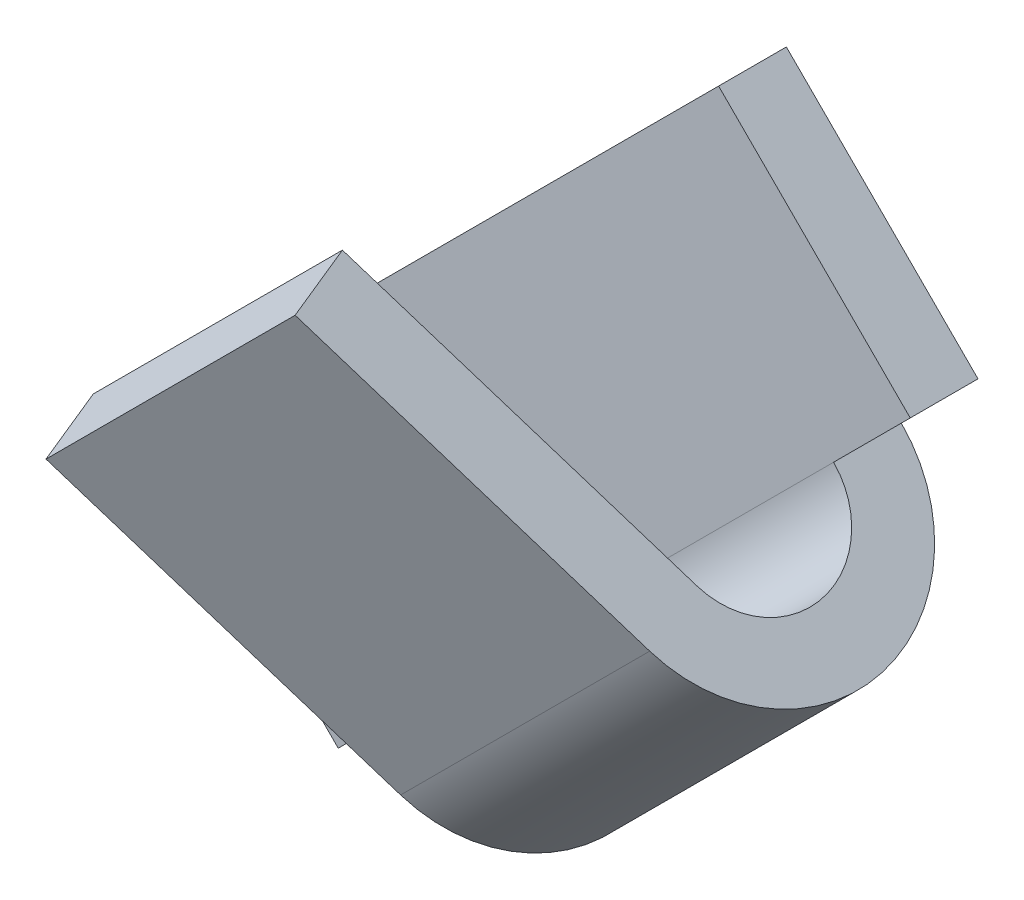
ISO-10303-21;
HEADER;
FILE_DESCRIPTION(('STEP AP214'),'2;1');
FILE_NAME('part.step','',(''),(''),'','','');
FILE_SCHEMA(('AUTOMOTIVE_DESIGN { 1 0 10303 214 1 1 1 1 }'));
ENDSEC;
DATA;
#1=APPLICATION_CONTEXT('core data for automotive mechanical design processes');
#2=APPLICATION_PROTOCOL_DEFINITION('international standard','automotive_design',2000,#1);
#3=PRODUCT_CONTEXT('',#1,'mechanical');
#4=PRODUCT('Part','Part','',(#3));
#5=PRODUCT_RELATED_PRODUCT_CATEGORY('part','',(#4));
#6=PRODUCT_DEFINITION_FORMATION('','',#4);
#7=PRODUCT_DEFINITION_CONTEXT('part definition',#1,'design');
#8=PRODUCT_DEFINITION('design','',#6,#7);
#9=PRODUCT_DEFINITION_SHAPE('','',#8);
#10=(LENGTH_UNIT() NAMED_UNIT(*) SI_UNIT(.MILLI.,.METRE.));
#11=(NAMED_UNIT(*) PLANE_ANGLE_UNIT() SI_UNIT($,.RADIAN.));
#12=(NAMED_UNIT(*) SI_UNIT($,.STERADIAN.) SOLID_ANGLE_UNIT());
#13=UNCERTAINTY_MEASURE_WITH_UNIT(LENGTH_MEASURE(1.E-05),#10,'distance_accuracy_value','');
#14=(GEOMETRIC_REPRESENTATION_CONTEXT(3) GLOBAL_UNCERTAINTY_ASSIGNED_CONTEXT((#13)) GLOBAL_UNIT_ASSIGNED_CONTEXT((#10,
#11,#12)) REPRESENTATION_CONTEXT('',''));
#15=CARTESIAN_POINT('',(0.,0.,0.));
#16=DIRECTION('',(0.,0.,1.));
#17=DIRECTION('',(1.,0.,0.));
#18=AXIS2_PLACEMENT_3D('',#15,#16,#17);
#19=CARTESIAN_POINT('',(4.64498533103,5.521919424801,1.061764101958));
#20=DIRECTION('',(-0.241844762647976,0.241844762647976,-0.939692620785908));
#21=DIRECTION('',(-0.968440830991091,0.,0.249243569363955));
#22=AXIS2_PLACEMENT_3D('',#19,#20,#21);
#23=PLANE('',#22);
#24=DIRECTION('',(0.707106781186548,0.707106781186548,0.));
#25=VECTOR('',#24,1.);
#26=CARTESIAN_POINT('',(5.56422414657215,6.44115824034385,1.06176410195818));
#27=LINE('',#26,#25);
#28=CARTESIAN_POINT('',(4.64498533102988,5.52191942480112,1.06176410195806));
#29=VERTEX_POINT('',#28);
#30=CARTESIAN_POINT('',(5.56422414657205,6.44115824034395,1.06176410195806));
#31=VERTEX_POINT('',#30);
#32=EDGE_CURVE('E149',#29,#31,#27,.T.);
#33=ORIENTED_EDGE('',*,*,#32,.T.);
#34=DIRECTION('',(-0.664463024388629,0.664463024388629,0.342020143325844));
#35=VECTOR('',#34,1.);
#36=CARTESIAN_POINT('',(6.428026078278,5.577356308638,0.617137915634));
#37=LINE('',#36,#35);
#38=CARTESIAN_POINT('',(6.42802607827772,5.57735630863828,0.61713791563409));
#39=VERTEX_POINT('',#38);
#40=EDGE_CURVE('E143',#39,#31,#37,.T.);
#41=ORIENTED_EDGE('',*,*,#40,.F.);
#42=DIRECTION('',(-0.707106781186548,-0.707106781186548,0.));
#43=VECTOR('',#42,1.);
#44=CARTESIAN_POINT('',(4.42022403513598,3.56955426549603,0.617137915633901));
#45=LINE('',#44,#43);
#46=CARTESIAN_POINT('',(5.50878726273522,4.65811749309578,0.617137915633958));
#47=VERTEX_POINT('',#46);
#48=EDGE_CURVE('E139',#39,#47,#45,.T.);
#49=ORIENTED_EDGE('',*,*,#48,.T.);
#50=DIRECTION('',(0.664463024388539,-0.664463024388539,-0.342020143326194));
#51=VECTOR('',#50,1.);
#52=CARTESIAN_POINT('',(4.64498533103,5.521919424801,1.061764101958));
#53=LINE('',#52,#51);
#54=EDGE_CURVE('E142',#29,#47,#53,.T.);
#55=ORIENTED_EDGE('',*,*,#54,.F.);
#56=EDGE_LOOP('',(#33,#41,#49,#55));
#57=FACE_BOUND('',#56,.T.);
#58=ADVANCED_FACE('F17',(#57),#23,.T.);
#59=CARTESIAN_POINT('',(5.624685337234,6.380697049682,1.296687257154));
#60=DIRECTION('',(0.664463024388637,-0.664463024388637,-0.342020143325813));
#61=DIRECTION('',(0.707106781186548,0.707106781186548,0.));
#62=AXIS2_PLACEMENT_3D('',#59,#60,#61);
#63=PLANE('',#62);
#64=ORIENTED_EDGE('',*,*,#32,.F.);
#65=DIRECTION('',(-0.241844762648429,0.241844762648429,-0.939692620785675));
#66=VECTOR('',#65,1.);
#67=CARTESIAN_POINT('',(4.705446521692,5.461458234139,1.296687257154));
#68=LINE('',#67,#66);
#69=CARTESIAN_POINT('',(4.70544652169198,5.46145823413902,1.29668725715392));
#70=VERTEX_POINT('',#69);
#71=EDGE_CURVE('E159',#70,#29,#68,.T.);
#72=ORIENTED_EDGE('',*,*,#71,.F.);
#73=DIRECTION('',(-0.707106781186208,-0.707106781186887,-1.7497355060574E-13));
#74=VECTOR('',#73,1.);
#75=CARTESIAN_POINT('',(5.624685337234,6.380697049682,1.296687257154));
#76=LINE('',#75,#74);
#77=CARTESIAN_POINT('',(5.624685337234,6.380697049682,1.296687257154));
#78=VERTEX_POINT('',#77);
#79=EDGE_CURVE('E148',#78,#70,#76,.T.);
#80=ORIENTED_EDGE('',*,*,#79,.F.);
#81=DIRECTION('',(0.241844762648432,-0.241844762648432,0.939692620785673));
#82=VECTOR('',#81,1.);
#83=CARTESIAN_POINT('',(5.564224146572,6.441158240344,1.061764101958));
#84=LINE('',#83,#82);
#85=EDGE_CURVE('E178',#31,#78,#84,.T.);
#86=ORIENTED_EDGE('',*,*,#85,.F.);
#87=EDGE_LOOP('',(#64,#72,#80,#86));
#88=FACE_BOUND('',#87,.T.);
#89=ADVANCED_FACE('F557',(#88),#63,.F.);
#90=CARTESIAN_POINT('',(4.348442540909,3.641335759723,0.338229496469));
#91=DIRECTION('',(-0.707106781186548,-0.707106781186548,0.));
#92=DIRECTION('',(0.707106781186548,-0.707106781186548,0.));
#93=AXIS2_PLACEMENT_3D('',#90,#91,#92);
#94=CYLINDRICAL_SURFACE('',#93,0.296808140232);
#95=DIRECTION('',(-0.707106781186163,-0.707106781186932,0.));
#96=VECTOR('',#95,1.);
#97=CARTESIAN_POINT('',(6.356244584051,5.649137802865,0.04142135623731));
#98=LINE('',#97,#96);
#99=CARTESIAN_POINT('',(6.35624458405125,5.64913780286475,0.0414213562371551));
#100=VERTEX_POINT('',#99);
#101=CARTESIAN_POINT('',(5.437005768509,4.729898987322,0.0414213562371551));
#102=VERTEX_POINT('',#101);
#103=EDGE_CURVE('E163',#100,#102,#98,.T.);
#104=ORIENTED_EDGE('',*,*,#103,.T.);
#105=CARTESIAN_POINT('',(5.4370057685085,4.7298989873225,0.338229496469));
#106=DIRECTION('',(-0.707106781186548,-0.707106781186548,0.));
#107=DIRECTION('',(0.707106781186548,-0.707106781186548,0.));
#108=AXIS2_PLACEMENT_3D('',#105,#106,#107);
#109=CIRCLE('',#108,0.296808140232);
#110=EDGE_CURVE('E20',#47,#102,#109,.F.);
#111=ORIENTED_EDGE('',*,*,#110,.F.);
#112=ORIENTED_EDGE('',*,*,#48,.F.);
#113=CARTESIAN_POINT('',(6.356244584051,5.649137802865,0.338229496469));
#114=DIRECTION('',(-0.707106781186548,-0.707106781186548,0.));
#115=DIRECTION('',(0.707106781186548,-0.707106781186548,0.));
#116=AXIS2_PLACEMENT_3D('',#113,#114,#115);
#117=CIRCLE('',#116,0.296808140232);
#118=EDGE_CURVE('E160',#100,#39,#117,.T.);
#119=ORIENTED_EDGE('',*,*,#118,.F.);
#120=EDGE_LOOP('',(#104,#111,#112,#119));
#121=FACE_BOUND('',#120,.T.);
#122=ADVANCED_FACE('F162',(#121),#94,.F.);
#123=CARTESIAN_POINT('',(5.624685337234,6.380697049682,1.296687257154));
#124=DIRECTION('',(0.241844762647976,-0.241844762647976,0.939692620785908));
#125=DIRECTION('',(0.968440830991091,0.,-0.249243569363955));
#126=AXIS2_PLACEMENT_3D('',#123,#124,#125);
#127=PLANE('',#126);
#128=ORIENTED_EDGE('',*,*,#79,.T.);
#129=DIRECTION('',(-0.664463024388714,0.664463024388714,0.342020143325515));
#130=VECTOR('',#129,1.);
#131=CARTESIAN_POINT('',(5.569248453397,4.597656302434,0.852061070831));
#132=LINE('',#131,#130);
#133=CARTESIAN_POINT('',(5.56924845339713,4.59765630243386,0.85206107083074));
#134=VERTEX_POINT('',#133);
#135=EDGE_CURVE('E165',#134,#70,#132,.T.);
#136=ORIENTED_EDGE('',*,*,#135,.F.);
#137=DIRECTION('',(-0.707106781186548,-0.707106781186548,0.));
#138=VECTOR('',#137,1.);
#139=CARTESIAN_POINT('',(4.48068522579786,3.50909307483415,0.852061070830437));
#140=LINE('',#139,#138);
#141=CARTESIAN_POINT('',(6.4884872689396,5.5168951179764,0.852061070830889));
#142=VERTEX_POINT('',#141);
#143=EDGE_CURVE('E212',#142,#134,#140,.T.);
#144=ORIENTED_EDGE('',*,*,#143,.F.);
#145=DIRECTION('',(0.664463024388804,-0.664463024388804,-0.342020143325165));
#146=VECTOR('',#145,1.);
#147=CARTESIAN_POINT('',(5.624685337234,6.380697049682,1.296687257154));
#148=LINE('',#147,#146);
#149=EDGE_CURVE('E180',#78,#142,#148,.T.);
#150=ORIENTED_EDGE('',*,*,#149,.F.);
#151=EDGE_LOOP('',(#128,#136,#144,#150));
#152=FACE_BOUND('',#151,.T.);
#153=ADVANCED_FACE('F312',(#152),#127,.T.);
#154=CARTESIAN_POINT('',(5.508787262735,4.658117493096,0.617137915634));
#155=DIRECTION('',(-0.707106781186548,-0.707106781186548,0.));
#156=DIRECTION('',(0.707106781186548,-0.707106781186548,0.));
#157=AXIS2_PLACEMENT_3D('',#154,#155,#156);
#158=PLANE('',#157);
#159=ORIENTED_EDGE('',*,*,#71,.T.);
#160=ORIENTED_EDGE('',*,*,#54,.T.);
#161=ORIENTED_EDGE('',*,*,#110,.T.);
#162=DIRECTION('',(0.,0.,1.));
#163=VECTOR('',#162,1.);
#164=CARTESIAN_POINT('',(5.437005768509,4.729898987322,0.25));
#165=LINE('',#164,#163);
#166=CARTESIAN_POINT('',(5.437005768509,4.729898987322,-0.208578643763));
#167=VERTEX_POINT('',#166);
#168=EDGE_CURVE('E221',#102,#167,#165,.F.);
#169=ORIENTED_EDGE('',*,*,#168,.T.);
#170=CARTESIAN_POINT('',(5.4370057685085,4.7298989873225,0.338229496469));
#171=DIRECTION('',(-0.707106781186548,-0.707106781186548,0.));
#172=DIRECTION('',(0.707106781186548,-0.707106781186548,0.));
#173=AXIS2_PLACEMENT_3D('',#170,#171,#172);
#174=CIRCLE('',#173,0.546808140232);
#175=EDGE_CURVE('E210',#134,#167,#174,.F.);
#176=ORIENTED_EDGE('',*,*,#175,.F.);
#177=ORIENTED_EDGE('',*,*,#135,.T.);
#178=EDGE_LOOP('',(#159,#160,#161,#169,#176,#177));
#179=FACE_BOUND('',#178,.T.);
#180=ADVANCED_FACE('F154',(#179),#158,.T.);
#181=CARTESIAN_POINT('',(6.428026078278,5.577356308638,0.617137915634));
#182=DIRECTION('',(0.707106781186548,0.707106781186548,0.));
#183=DIRECTION('',(-0.707106781186548,0.707106781186548,0.));
#184=AXIS2_PLACEMENT_3D('',#181,#182,#183);
#185=PLANE('',#184);
#186=ORIENTED_EDGE('',*,*,#85,.T.);
#187=ORIENTED_EDGE('',*,*,#149,.T.);
#188=CARTESIAN_POINT('',(6.356244584051,5.649137802865,0.338229496469));
#189=DIRECTION('',(-0.707106781186548,-0.707106781186548,0.));
#190=DIRECTION('',(0.707106781186548,-0.707106781186548,0.));
#191=AXIS2_PLACEMENT_3D('',#188,#189,#190);
#192=CIRCLE('',#191,0.546808140232);
#193=CARTESIAN_POINT('',(6.35624458405125,5.64913780286475,-0.208578643763));
#194=VERTEX_POINT('',#193);
#195=EDGE_CURVE('E206',#194,#142,#192,.T.);
#196=ORIENTED_EDGE('',*,*,#195,.F.);
#197=DIRECTION('',(0.,0.,1.));
#198=VECTOR('',#197,1.);
#199=CARTESIAN_POINT('',(6.3562445840515,5.6491378028645,0.25));
#200=LINE('',#199,#198);
#201=EDGE_CURVE('E209',#194,#100,#200,.T.);
#202=ORIENTED_EDGE('',*,*,#201,.T.);
#203=ORIENTED_EDGE('',*,*,#118,.T.);
#204=ORIENTED_EDGE('',*,*,#40,.T.);
#205=EDGE_LOOP('',(#186,#187,#196,#202,#203,#204));
#206=FACE_BOUND('',#205,.T.);
#207=ADVANCED_FACE('F303',(#206),#185,.T.);
#208=CARTESIAN_POINT('',(4.974873734153,4.267766952966,-0.1));
#209=DIRECTION('',(0.707106781186548,-0.707106781186548,0.));
#210=DIRECTION('',(0.707106781186548,0.707106781186548,0.));
#211=AXIS2_PLACEMENT_3D('',#208,#209,#210);
#212=CYLINDRICAL_SURFACE('',#211,0.1);
#213=DIRECTION('',(0.707106781186548,-0.707106781186548,0.));
#214=VECTOR('',#213,1.);
#215=CARTESIAN_POINT('',(4.317766952966,5.024873734153,-0.02928932188135));
#216=LINE('',#215,#214);
#217=CARTESIAN_POINT('',(4.31776695296596,5.02487373415296,-0.0292893218812934));
#218=VERTEX_POINT('',#217);
#219=CARTESIAN_POINT('',(5.02487373415296,4.31776695296596,-0.0292893218812933));
#220=VERTEX_POINT('',#219);
#221=EDGE_CURVE('E296',#218,#220,#216,.T.);
#222=ORIENTED_EDGE('',*,*,#221,.T.);
#223=CARTESIAN_POINT('',(4.974873734153,4.267766952966,-0.1));
#224=DIRECTION('',(0.707106781186548,-0.707106781186548,0.));
#225=DIRECTION('',(0.707106781186548,0.707106781186548,0.));
#226=AXIS2_PLACEMENT_3D('',#223,#224,#225);
#227=CIRCLE('',#226,0.1);
#228=CARTESIAN_POINT('',(4.974873734153,4.267766952966,0.));
#229=VERTEX_POINT('',#228);
#230=EDGE_CURVE('E213',#220,#229,#227,.T.);
#231=ORIENTED_EDGE('',*,*,#230,.T.);
#232=DIRECTION('',(-0.707106781186547,0.707106781186547,0.));
#233=VECTOR('',#232,1.);
#234=CARTESIAN_POINT('',(4.974873734153,4.267766952966,0.));
#235=LINE('',#234,#233);
#236=CARTESIAN_POINT('',(4.267766952966,4.974873734153,0.));
#237=VERTEX_POINT('',#236);
#238=EDGE_CURVE('E266',#229,#237,#235,.T.);
#239=ORIENTED_EDGE('',*,*,#238,.T.);
#240=CARTESIAN_POINT('',(4.267766952966,4.974873734153,-0.1));
#241=DIRECTION('',(0.707106781186548,-0.707106781186548,0.));
#242=DIRECTION('',(0.707106781186548,0.707106781186548,0.));
#243=AXIS2_PLACEMENT_3D('',#240,#241,#242);
#244=CIRCLE('',#243,0.1);
#245=EDGE_CURVE('E202',#237,#218,#244,.F.);
#246=ORIENTED_EDGE('',*,*,#245,.T.);
#247=EDGE_LOOP('',(#222,#231,#239,#246));
#248=FACE_BOUND('',#247,.T.);
#249=ADVANCED_FACE('F514',(#248),#212,.F.);
#250=CARTESIAN_POINT('',(5.024873734153,4.317766952966,-0.02928932188135));
#251=DIRECTION('',(0.49999999999984,0.49999999999984,0.707106781186774));
#252=DIRECTION('',(0.8164965809279,0.,-0.577350269189379));
#253=AXIS2_PLACEMENT_3D('',#250,#251,#252);
#254=PLANE('',#253);
#255=DIRECTION('',(0.707106781186548,-0.707106781186548,0.));
#256=VECTOR('',#255,1.);
#257=CARTESIAN_POINT('',(5.09987373415288,4.39276695296588,-0.135355339059164));
#258=LINE('',#257,#256);
#259=CARTESIAN_POINT('',(5.0998737341531,4.3927669529661,-0.135355339059302));
#260=VERTEX_POINT('',#259);
#261=CARTESIAN_POINT('',(4.3927669529661,5.0998737341531,-0.135355339059302));
#262=VERTEX_POINT('',#261);
#263=EDGE_CURVE('E229',#260,#262,#258,.F.);
#264=ORIENTED_EDGE('',*,*,#263,.F.);
#265=DIRECTION('',(-0.500000000000781,-0.500000000000781,0.707106781185443));
#266=VECTOR('',#265,1.);
#267=CARTESIAN_POINT('',(5.099873734153,4.392766952966,-0.135355339059));
#268=LINE('',#267,#266);
#269=EDGE_CURVE('E217',#260,#220,#268,.T.);
#270=ORIENTED_EDGE('',*,*,#269,.T.);
#271=ORIENTED_EDGE('',*,*,#221,.F.);
#272=DIRECTION('',(0.500000000000781,0.500000000000781,-0.707106781185443));
#273=VECTOR('',#272,1.);
#274=CARTESIAN_POINT('',(4.317766952966,5.024873734153,-0.0292893218813501));
#275=LINE('',#274,#273);
#276=EDGE_CURVE('E201',#218,#262,#275,.T.);
#277=ORIENTED_EDGE('',*,*,#276,.T.);
#278=EDGE_LOOP('',(#264,#270,#271,#277));
#279=FACE_BOUND('',#278,.T.);
#280=ADVANCED_FACE('F505',(#279),#254,.F.);
#281=CARTESIAN_POINT('',(6.639087296526,5.931980515339,0.04142135623731));
#282=DIRECTION('',(0.,0.,-1.));
#283=DIRECTION('',(-1.,0.,0.));
#284=AXIS2_PLACEMENT_3D('',#281,#282,#283);
#285=PLANE('',#284);
#286=DIRECTION('',(0.707106781186548,-0.707106781186548,0.));
#287=VECTOR('',#286,1.);
#288=CARTESIAN_POINT('',(5.224873734153,4.517766952966,0.0414213562369999));
#289=LINE('',#288,#287);
#290=CARTESIAN_POINT('',(4.517766952966,5.224873734153,0.0414213562371549));
#291=VERTEX_POINT('',#290);
#292=CARTESIAN_POINT('',(5.224873734153,4.517766952966,0.0414213562371549));
#293=VERTEX_POINT('',#292);
#294=EDGE_CURVE('E289',#291,#293,#289,.T.);
#295=ORIENTED_EDGE('',*,*,#294,.T.);
#296=DIRECTION('',(-0.707106781186548,-0.707106781186548,0.));
#297=VECTOR('',#296,1.);
#298=CARTESIAN_POINT('',(3.207106781187,2.5,0.0414213562373099));
#299=LINE('',#298,#297);
#300=EDGE_CURVE('E225',#293,#102,#299,.F.);
#301=ORIENTED_EDGE('',*,*,#300,.T.);
#302=ORIENTED_EDGE('',*,*,#103,.F.);
#303=DIRECTION('',(-0.707106781186548,-0.707106781186548,0.));
#304=VECTOR('',#303,1.);
#305=CARTESIAN_POINT('',(3.207106781187,2.5,0.0414213562373099));
#306=LINE('',#305,#304);
#307=CARTESIAN_POINT('',(6.639087296526,5.931980515339,0.04142135623731));
#308=VERTEX_POINT('',#307);
#309=EDGE_CURVE('E298',#100,#308,#306,.F.);
#310=ORIENTED_EDGE('',*,*,#309,.T.);
#311=DIRECTION('',(0.707106781186548,-0.707106781186548,0.));
#312=VECTOR('',#311,1.);
#313=CARTESIAN_POINT('',(6.639087296526,5.931980515339,0.04142135623731));
#314=LINE('',#313,#312);
#315=CARTESIAN_POINT('',(5.931980515339,6.639087296526,0.0414213562373099));
#316=VERTEX_POINT('',#315);
#317=EDGE_CURVE('E205',#308,#316,#314,.F.);
#318=ORIENTED_EDGE('',*,*,#317,.T.);
#319=DIRECTION('',(0.707106781186548,0.707106781186548,0.));
#320=VECTOR('',#319,1.);
#321=CARTESIAN_POINT('',(4.267766952966,4.974873734153,0.0414213562373099));
#322=LINE('',#321,#320);
#323=EDGE_CURVE('E197',#316,#291,#322,.F.);
#324=ORIENTED_EDGE('',*,*,#323,.T.);
#325=EDGE_LOOP('',(#295,#301,#302,#310,#318,#324));
#326=FACE_BOUND('',#325,.T.);
#327=ADVANCED_FACE('F387',(#326),#285,.F.);
#328=CARTESIAN_POINT('',(5.224873734153,4.517766952966,0.141421356237));
#329=DIRECTION('',(0.707106781186548,-0.707106781186548,0.));
#330=DIRECTION('',(0.707106781186548,0.707106781186548,0.));
#331=AXIS2_PLACEMENT_3D('',#328,#329,#330);
#332=CYLINDRICAL_SURFACE('',#331,0.1);
#333=DIRECTION('',(0.707106781186548,-0.707106781186548,0.));
#334=VECTOR('',#333,1.);
#335=CARTESIAN_POINT('',(4.46776695296615,5.17487373415315,0.0707106781188736));
#336=LINE('',#335,#334);
#337=CARTESIAN_POINT('',(4.46776695296609,5.17487373415309,0.0707106781187476));
#338=VERTEX_POINT('',#337);
#339=CARTESIAN_POINT('',(5.17487373415309,4.46776695296609,0.0707106781187476));
#340=VERTEX_POINT('',#339);
#341=EDGE_CURVE('E287',#338,#340,#336,.T.);
#342=ORIENTED_EDGE('',*,*,#341,.T.);
#343=CARTESIAN_POINT('',(5.224873734153,4.517766952966,0.141421356237));
#344=DIRECTION('',(0.707106781186548,-0.707106781186548,0.));
#345=DIRECTION('',(0.707106781186548,0.707106781186548,0.));
#346=AXIS2_PLACEMENT_3D('',#343,#344,#345);
#347=CIRCLE('',#346,0.1);
#348=EDGE_CURVE('E222',#340,#293,#347,.T.);
#349=ORIENTED_EDGE('',*,*,#348,.T.);
#350=ORIENTED_EDGE('',*,*,#294,.F.);
#351=CARTESIAN_POINT('',(4.517766952966,5.224873734153,0.141421356237));
#352=DIRECTION('',(0.707106781186548,-0.707106781186548,0.));
#353=DIRECTION('',(0.707106781186548,0.707106781186548,0.));
#354=AXIS2_PLACEMENT_3D('',#351,#352,#353);
#355=CIRCLE('',#354,0.1);
#356=EDGE_CURVE('E194',#291,#338,#355,.F.);
#357=ORIENTED_EDGE('',*,*,#356,.T.);
#358=EDGE_LOOP('',(#342,#349,#350,#357));
#359=FACE_BOUND('',#358,.T.);
#360=ADVANCED_FACE('F385',(#359),#332,.F.);
#361=CARTESIAN_POINT('',(5.099873734153,4.392766952966,0.176776695297));
#362=DIRECTION('',(-0.49999999999984,-0.49999999999984,-0.707106781186774));
#363=DIRECTION('',(-0.8164965809279,0.,0.57735026918938));
#364=AXIS2_PLACEMENT_3D('',#361,#362,#363);
#365=PLANE('',#364);
#366=DIRECTION('',(0.707106781186548,-0.707106781186548,0.));
#367=VECTOR('',#366,1.);
#368=CARTESIAN_POINT('',(5.09987373415287,4.39276695296587,0.176776695296818));
#369=LINE('',#368,#367);
#370=CARTESIAN_POINT('',(5.09987373415311,4.39276695296611,0.176776695296669));
#371=VERTEX_POINT('',#370);
#372=CARTESIAN_POINT('',(4.39276695296611,5.09987373415311,0.176776695296669));
#373=VERTEX_POINT('',#372);
#374=EDGE_CURVE('E285',#371,#373,#369,.F.);
#375=ORIENTED_EDGE('',*,*,#374,.F.);
#376=DIRECTION('',(0.499999999999156,0.499999999999151,-0.707106781187745));
#377=VECTOR('',#376,1.);
#378=CARTESIAN_POINT('',(5.099873734153,4.392766952966,0.176776695297));
#379=LINE('',#378,#377);
#380=EDGE_CURVE('E226',#371,#340,#379,.T.);
#381=ORIENTED_EDGE('',*,*,#380,.T.);
#382=ORIENTED_EDGE('',*,*,#341,.F.);
#383=DIRECTION('',(-0.499999999999155,-0.499999999999155,0.707106781187743));
#384=VECTOR('',#383,1.);
#385=CARTESIAN_POINT('',(4.467766952966,5.174873734153,0.0707106781186599));
#386=LINE('',#385,#384);
#387=EDGE_CURVE('E193',#338,#373,#386,.T.);
#388=ORIENTED_EDGE('',*,*,#387,.T.);
#389=EDGE_LOOP('',(#375,#381,#382,#388));
#390=FACE_BOUND('',#389,.T.);
#391=ADVANCED_FACE('F383',(#390),#365,.F.);
#392=CARTESIAN_POINT('',(4.974873734153,4.267766952966,0.));
#393=DIRECTION('',(0.707106781186548,-0.707106781186548,0.));
#394=DIRECTION('',(0.707106781186548,0.707106781186548,0.));
#395=AXIS2_PLACEMENT_3D('',#392,#393,#394);
#396=CYLINDRICAL_SURFACE('',#395,0.25);
#397=CARTESIAN_POINT('',(4.974873734153,4.267766952966,0.));
#398=DIRECTION('',(0.707106781186548,-0.707106781186548,0.));
#399=DIRECTION('',(0.707106781186548,0.707106781186548,0.));
#400=AXIS2_PLACEMENT_3D('',#397,#398,#399);
#401=CIRCLE('',#400,0.25);
#402=CARTESIAN_POINT('',(4.974873734153,4.267766952966,0.25));
#403=VERTEX_POINT('',#402);
#404=EDGE_CURVE('E227',#403,#371,#401,.F.);
#405=ORIENTED_EDGE('',*,*,#404,.T.);
#406=ORIENTED_EDGE('',*,*,#374,.T.);
#407=CARTESIAN_POINT('',(4.267766952966,4.974873734153,0.));
#408=DIRECTION('',(0.707106781186548,-0.707106781186548,0.));
#409=DIRECTION('',(0.707106781186548,0.707106781186548,0.));
#410=AXIS2_PLACEMENT_3D('',#407,#408,#409);
#411=CIRCLE('',#410,0.25);
#412=CARTESIAN_POINT('',(4.267766952966,4.974873734153,0.25));
#413=VERTEX_POINT('',#412);
#414=EDGE_CURVE('E189',#373,#413,#411,.T.);
#415=ORIENTED_EDGE('',*,*,#414,.T.);
#416=DIRECTION('',(-0.707106781186547,0.707106781186547,0.));
#417=VECTOR('',#416,1.);
#418=CARTESIAN_POINT('',(4.974873734153,4.267766952966,0.25));
#419=LINE('',#418,#417);
#420=EDGE_CURVE('E281',#403,#413,#419,.T.);
#421=ORIENTED_EDGE('',*,*,#420,.F.);
#422=EDGE_LOOP('',(#405,#406,#415,#421));
#423=FACE_BOUND('',#422,.T.);
#424=ADVANCED_FACE('F378',(#423),#396,.T.);
#425=CARTESIAN_POINT('',(0.,-0.707106781187,0.25));
#426=DIRECTION('',(0.,0.,1.));
#427=DIRECTION('',(1.,0.,0.));
#428=AXIS2_PLACEMENT_3D('',#425,#426,#427);
#429=PLANE('',#428);
#430=ORIENTED_EDGE('',*,*,#420,.T.);
#431=DIRECTION('',(0.707106781186548,0.707106781186548,0.));
#432=VECTOR('',#431,1.);
#433=CARTESIAN_POINT('',(4.267766952966,4.974873734153,0.25));
#434=LINE('',#433,#432);
#435=CARTESIAN_POINT('',(4.029988270759,4.737095051946,0.249999999999998));
#436=VERTEX_POINT('',#435);
#437=EDGE_CURVE('E192',#413,#436,#434,.F.);
#438=ORIENTED_EDGE('',*,*,#437,.T.);
#439=DIRECTION('',(-0.707106781186548,0.707106781186548,0.));
#440=VECTOR('',#439,1.);
#441=CARTESIAN_POINT('',(1.267083322705,7.5,0.249999999999993));
#442=LINE('',#441,#440);
#443=CARTESIAN_POINT('',(4.737095051946,4.029988270759,0.249999999999998));
#444=VERTEX_POINT('',#443);
#445=EDGE_CURVE('E270',#436,#444,#442,.F.);
#446=ORIENTED_EDGE('',*,*,#445,.T.);
#447=DIRECTION('',(-0.707106781186548,-0.707106781186548,0.));
#448=VECTOR('',#447,1.);
#449=CARTESIAN_POINT('',(3.207106781187,2.5,0.25));
#450=LINE('',#449,#448);
#451=EDGE_CURVE('E239',#444,#403,#450,.F.);
#452=ORIENTED_EDGE('',*,*,#451,.T.);
#453=EDGE_LOOP('',(#430,#438,#446,#452));
#454=FACE_BOUND('',#453,.T.);
#455=ADVANCED_FACE('F373',(#454),#429,.T.);
#456=CARTESIAN_POINT('',(1.267083322705,7.5,21.289254270812));
#457=DIRECTION('',(0.707106781186548,0.707106781186548,0.));
#458=DIRECTION('',(-0.707106781186548,0.707106781186548,0.));
#459=AXIS2_PLACEMENT_3D('',#456,#457,#458);
#460=PLANE('',#459);
#461=DIRECTION('',(0.,0.,1.));
#462=VECTOR('',#461,1.);
#463=CARTESIAN_POINT('',(4.029988270759,4.737095051946,0.25));
#464=LINE('',#463,#462);
#465=CARTESIAN_POINT('',(4.029988270759,4.737095051946,0.));
#466=VERTEX_POINT('',#465);
#467=EDGE_CURVE('E274',#436,#466,#464,.F.);
#468=ORIENTED_EDGE('',*,*,#467,.T.);
#469=DIRECTION('',(0.707106781186548,-0.707106781186547,0.));
#470=VECTOR('',#469,1.);
#471=CARTESIAN_POINT('',(4.029988270759,4.737095051946,0.));
#472=LINE('',#471,#470);
#473=CARTESIAN_POINT('',(4.737095051946,4.029988270759,0.));
#474=VERTEX_POINT('',#473);
#475=EDGE_CURVE('E269',#466,#474,#472,.T.);
#476=ORIENTED_EDGE('',*,*,#475,.T.);
#477=DIRECTION('',(0.,0.,1.));
#478=VECTOR('',#477,1.);
#479=CARTESIAN_POINT('',(4.737095051946,4.029988270759,0.25));
#480=LINE('',#479,#478);
#481=EDGE_CURVE('E244',#474,#444,#480,.T.);
#482=ORIENTED_EDGE('',*,*,#481,.T.);
#483=ORIENTED_EDGE('',*,*,#445,.F.);
#484=EDGE_LOOP('',(#468,#476,#482,#483));
#485=FACE_BOUND('',#484,.T.);
#486=ADVANCED_FACE('F370',(#485),#460,.F.);
#487=CARTESIAN_POINT('',(0.,-0.707106781187,0.));
#488=DIRECTION('',(0.,0.,1.));
#489=DIRECTION('',(1.,0.,0.));
#490=AXIS2_PLACEMENT_3D('',#487,#488,#489);
#491=PLANE('',#490);
#492=ORIENTED_EDGE('',*,*,#475,.F.);
#493=DIRECTION('',(0.707106781186548,0.707106781186548,0.));
#494=VECTOR('',#493,1.);
#495=CARTESIAN_POINT('',(4.267766952966,4.974873734153,0.));
#496=LINE('',#495,#494);
#497=EDGE_CURVE('E277',#466,#237,#496,.T.);
#498=ORIENTED_EDGE('',*,*,#497,.T.);
#499=ORIENTED_EDGE('',*,*,#238,.F.);
#500=DIRECTION('',(-0.707106781186548,-0.707106781186548,0.));
#501=VECTOR('',#500,1.);
#502=CARTESIAN_POINT('',(3.207106781187,2.5,0.));
#503=LINE('',#502,#501);
#504=EDGE_CURVE('E216',#229,#474,#503,.T.);
#505=ORIENTED_EDGE('',*,*,#504,.T.);
#506=EDGE_LOOP('',(#492,#498,#499,#505));
#507=FACE_BOUND('',#506,.T.);
#508=ADVANCED_FACE('F365',(#507),#491,.F.);
#509=CARTESIAN_POINT('',(5.224873734153,4.517766952966,0.04142135623731));
#510=DIRECTION('',(0.707106781186548,-0.707106781186548,0.));
#511=DIRECTION('',(0.707106781186548,0.707106781186548,0.));
#512=AXIS2_PLACEMENT_3D('',#509,#510,#511);
#513=CYLINDRICAL_SURFACE('',#512,0.25);
#514=CARTESIAN_POINT('',(5.224873734153,4.517766952966,0.04142135623731));
#515=DIRECTION('',(0.707106781186548,-0.707106781186548,0.));
#516=DIRECTION('',(0.707106781186548,0.707106781186548,0.));
#517=AXIS2_PLACEMENT_3D('',#514,#515,#516);
#518=CIRCLE('',#517,0.25);
#519=CARTESIAN_POINT('',(5.224873734153,4.517766952966,-0.208578643763));
#520=VERTEX_POINT('',#519);
#521=EDGE_CURVE('E218',#520,#260,#518,.F.);
#522=ORIENTED_EDGE('',*,*,#521,.T.);
#523=ORIENTED_EDGE('',*,*,#263,.T.);
#524=CARTESIAN_POINT('',(4.517766952966,5.224873734153,0.04142135623731));
#525=DIRECTION('',(0.707106781186548,-0.707106781186548,0.));
#526=DIRECTION('',(0.707106781186548,0.707106781186548,0.));
#527=AXIS2_PLACEMENT_3D('',#524,#525,#526);
#528=CIRCLE('',#527,0.25);
#529=CARTESIAN_POINT('',(4.517766952966,5.224873734153,-0.208578643763));
#530=VERTEX_POINT('',#529);
#531=EDGE_CURVE('E198',#262,#530,#528,.T.);
#532=ORIENTED_EDGE('',*,*,#531,.T.);
#533=DIRECTION('',(0.707106781186547,-0.707106781186547,0.));
#534=VECTOR('',#533,1.);
#535=CARTESIAN_POINT('',(4.517766952966,5.224873734153,-0.208578643763));
#536=LINE('',#535,#534);
#537=EDGE_CURVE('E328',#530,#520,#536,.T.);
#538=ORIENTED_EDGE('',*,*,#537,.T.);
#539=EDGE_LOOP('',(#522,#523,#532,#538));
#540=FACE_BOUND('',#539,.T.);
#541=ADVANCED_FACE('F439',(#540),#513,.T.);
#542=CARTESIAN_POINT('',(3.207106781187,2.5,0.25));
#543=DIRECTION('',(-0.707106781186548,0.707106781186548,0.));
#544=DIRECTION('',(-0.707106781186548,-0.707106781186548,0.));
#545=AXIS2_PLACEMENT_3D('',#542,#543,#544);
#546=PLANE('',#545);
#547=ORIENTED_EDGE('',*,*,#481,.F.);
#548=ORIENTED_EDGE('',*,*,#504,.F.);
#549=ORIENTED_EDGE('',*,*,#230,.F.);
#550=ORIENTED_EDGE('',*,*,#269,.F.);
#551=ORIENTED_EDGE('',*,*,#521,.F.);
#552=DIRECTION('',(0.707106781186548,0.707106781186548,0.));
#553=VECTOR('',#552,1.);
#554=CARTESIAN_POINT('',(5.224873734153,4.517766952966,-0.208578643763));
#555=LINE('',#554,#553);
#556=EDGE_CURVE('E321',#520,#167,#555,.T.);
#557=ORIENTED_EDGE('',*,*,#556,.T.);
#558=ORIENTED_EDGE('',*,*,#168,.F.);
#559=ORIENTED_EDGE('',*,*,#300,.F.);
#560=ORIENTED_EDGE('',*,*,#348,.F.);
#561=ORIENTED_EDGE('',*,*,#380,.F.);
#562=ORIENTED_EDGE('',*,*,#404,.F.);
#563=ORIENTED_EDGE('',*,*,#451,.F.);
#564=EDGE_LOOP('',(#547,#548,#549,#550,#551,#557,#558,#559,#560,#561,#562,#563));
#565=FACE_BOUND('',#564,.T.);
#566=ADVANCED_FACE('F326',(#565),#546,.F.);
#567=CARTESIAN_POINT('',(4.348442540909,3.641335759723,0.338229496469));
#568=DIRECTION('',(-0.707106781186548,-0.707106781186548,0.));
#569=DIRECTION('',(0.707106781186548,-0.707106781186548,0.));
#570=AXIS2_PLACEMENT_3D('',#567,#568,#569);
#571=CYLINDRICAL_SURFACE('',#570,0.546808140232);
#572=DIRECTION('',(0.707106781186163,0.707106781186932,0.));
#573=VECTOR('',#572,1.);
#574=CARTESIAN_POINT('',(5.437005768509,4.729898987322,-0.208578643763));
#575=LINE('',#574,#573);
#576=EDGE_CURVE('E311',#167,#194,#575,.T.);
#577=ORIENTED_EDGE('',*,*,#576,.T.);
#578=ORIENTED_EDGE('',*,*,#195,.T.);
#579=ORIENTED_EDGE('',*,*,#143,.T.);
#580=ORIENTED_EDGE('',*,*,#175,.T.);
#581=EDGE_LOOP('',(#577,#578,#579,#580));
#582=FACE_BOUND('',#581,.T.);
#583=ADVANCED_FACE('F309',(#582),#571,.T.);
#584=CARTESIAN_POINT('',(3.207106781187,2.5,0.25));
#585=DIRECTION('',(-0.707106781186548,0.707106781186548,0.));
#586=DIRECTION('',(-0.707106781186548,-0.707106781186548,0.));
#587=AXIS2_PLACEMENT_3D('',#584,#585,#586);
#588=PLANE('',#587);
#589=ORIENTED_EDGE('',*,*,#201,.F.);
#590=DIRECTION('',(0.707106781187798,0.707106781185297,0.));
#591=VECTOR('',#590,1.);
#592=CARTESIAN_POINT('',(6.356244584051,5.649137802865,-0.208578643763));
#593=LINE('',#592,#591);
#594=CARTESIAN_POINT('',(6.639087296526,5.931980515339,-0.208578643763));
#595=VERTEX_POINT('',#594);
#596=EDGE_CURVE('E324',#194,#595,#593,.T.);
#597=ORIENTED_EDGE('',*,*,#596,.T.);
#598=DIRECTION('',(0.,0.,1.));
#599=VECTOR('',#598,1.);
#600=CARTESIAN_POINT('',(6.639087296526,5.931980515339,0.04142135623731));
#601=LINE('',#600,#599);
#602=EDGE_CURVE('E292',#595,#308,#601,.T.);
#603=ORIENTED_EDGE('',*,*,#602,.T.);
#604=ORIENTED_EDGE('',*,*,#309,.F.);
#605=EDGE_LOOP('',(#589,#597,#603,#604));
#606=FACE_BOUND('',#605,.T.);
#607=ADVANCED_FACE('F392',(#606),#588,.F.);
#608=CARTESIAN_POINT('',(6.639087296526,5.931980515339,0.04142135623731));
#609=DIRECTION('',(-0.707106781186548,-0.707106781186548,0.));
#610=DIRECTION('',(0.707106781186548,-0.707106781186548,0.));
#611=AXIS2_PLACEMENT_3D('',#608,#609,#610);
#612=PLANE('',#611);
#613=ORIENTED_EDGE('',*,*,#317,.F.);
#614=ORIENTED_EDGE('',*,*,#602,.F.);
#615=DIRECTION('',(-0.707106781186547,0.707106781186547,0.));
#616=VECTOR('',#615,1.);
#617=CARTESIAN_POINT('',(6.639087296526,5.931980515339,-0.208578643763));
#618=LINE('',#617,#616);
#619=CARTESIAN_POINT('',(5.931980515339,6.639087296526,-0.208578643763));
#620=VERTEX_POINT('',#619);
#621=EDGE_CURVE('E26',#595,#620,#618,.T.);
#622=ORIENTED_EDGE('',*,*,#621,.T.);
#623=DIRECTION('',(0.,0.,1.));
#624=VECTOR('',#623,1.);
#625=CARTESIAN_POINT('',(5.931980515339,6.639087296526,0.25));
#626=LINE('',#625,#624);
#627=EDGE_CURVE('E34',#620,#316,#626,.T.);
#628=ORIENTED_EDGE('',*,*,#627,.T.);
#629=EDGE_LOOP('',(#613,#614,#622,#628));
#630=FACE_BOUND('',#629,.T.);
#631=ADVANCED_FACE('F390',(#630),#612,.F.);
#632=CARTESIAN_POINT('',(4.267766952966,4.974873734153,0.25));
#633=DIRECTION('',(0.707106781186548,-0.707106781186548,0.));
#634=DIRECTION('',(0.707106781186548,0.707106781186548,0.));
#635=AXIS2_PLACEMENT_3D('',#632,#633,#634);
#636=PLANE('',#635);
#637=ORIENTED_EDGE('',*,*,#467,.F.);
#638=ORIENTED_EDGE('',*,*,#437,.F.);
#639=ORIENTED_EDGE('',*,*,#414,.F.);
#640=ORIENTED_EDGE('',*,*,#387,.F.);
#641=ORIENTED_EDGE('',*,*,#356,.F.);
#642=ORIENTED_EDGE('',*,*,#323,.F.);
#643=ORIENTED_EDGE('',*,*,#627,.F.);
#644=DIRECTION('',(-0.707106781186548,-0.707106781186548,0.));
#645=VECTOR('',#644,1.);
#646=CARTESIAN_POINT('',(5.931980515339,6.639087296526,-0.208578643763));
#647=LINE('',#646,#645);
#648=EDGE_CURVE('E11',#620,#530,#647,.T.);
#649=ORIENTED_EDGE('',*,*,#648,.T.);
#650=ORIENTED_EDGE('',*,*,#531,.F.);
#651=ORIENTED_EDGE('',*,*,#276,.F.);
#652=ORIENTED_EDGE('',*,*,#245,.F.);
#653=ORIENTED_EDGE('',*,*,#497,.F.);
#654=EDGE_LOOP('',(#637,#638,#639,#640,#641,#642,#643,#649,#650,#651,#652,#653));
#655=FACE_BOUND('',#654,.T.);
#656=ADVANCED_FACE('F367',(#655),#636,.F.);
#657=CARTESIAN_POINT('',(6.639087296526,5.931980515339,-0.208578643763));
#658=DIRECTION('',(0.,0.,1.));
#659=DIRECTION('',(1.,0.,0.));
#660=AXIS2_PLACEMENT_3D('',#657,#658,#659);
#661=PLANE('',#660);
#662=ORIENTED_EDGE('',*,*,#621,.F.);
#663=ORIENTED_EDGE('',*,*,#596,.F.);
#664=ORIENTED_EDGE('',*,*,#576,.F.);
#665=ORIENTED_EDGE('',*,*,#556,.F.);
#666=ORIENTED_EDGE('',*,*,#537,.F.);
#667=ORIENTED_EDGE('',*,*,#648,.F.);
#668=EDGE_LOOP('',(#662,#663,#664,#665,#666,#667));
#669=FACE_BOUND('',#668,.T.);
#670=ADVANCED_FACE('F320',(#669),#661,.F.);
#671=CLOSED_SHELL('',(#58,#89,#122,#153,#180,#207,#249,#280,#327,#360,#391,#424,#455,#486,#508,
#541,#566,#583,#607,#631,#656,#670));
#672=MANIFOLD_SOLID_BREP('B1',#671);
#673=ADVANCED_BREP_SHAPE_REPRESENTATION('',(#18,#672),#14);
#674=SHAPE_DEFINITION_REPRESENTATION(#9,#673);
ENDSEC;
END-ISO-10303-21;
